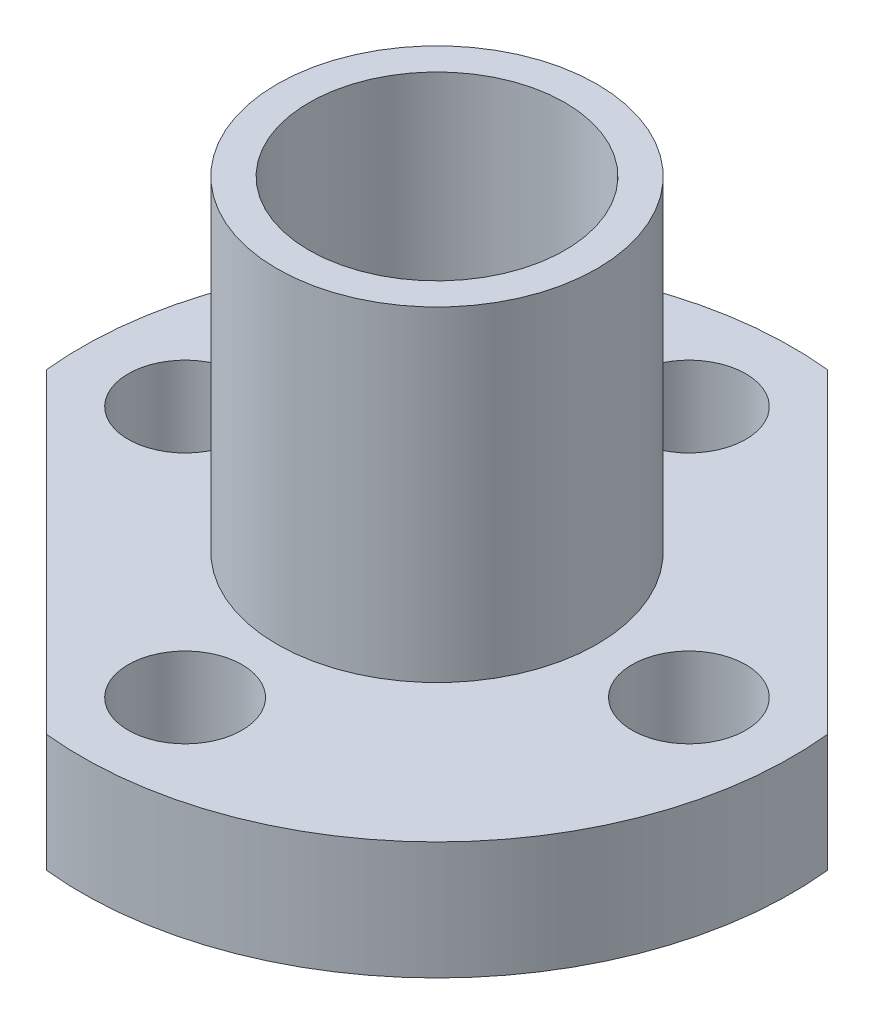
ISO-10303-21;
HEADER;
FILE_DESCRIPTION(('STEP AP214'),'2;1');
FILE_NAME('part.step','',(''),(''),'','','');
FILE_SCHEMA(('AUTOMOTIVE_DESIGN { 1 0 10303 214 1 1 1 1 }'));
ENDSEC;
DATA;
#1=APPLICATION_CONTEXT('core data for automotive mechanical design processes');
#2=APPLICATION_PROTOCOL_DEFINITION('international standard','automotive_design',2000,#1);
#3=PRODUCT_CONTEXT('',#1,'mechanical');
#4=PRODUCT('Part','Part','',(#3));
#5=PRODUCT_RELATED_PRODUCT_CATEGORY('part','',(#4));
#6=PRODUCT_DEFINITION_FORMATION('','',#4);
#7=PRODUCT_DEFINITION_CONTEXT('part definition',#1,'design');
#8=PRODUCT_DEFINITION('design','',#6,#7);
#9=PRODUCT_DEFINITION_SHAPE('','',#8);
#10=(LENGTH_UNIT() NAMED_UNIT(*) SI_UNIT(.MILLI.,.METRE.));
#11=(NAMED_UNIT(*) PLANE_ANGLE_UNIT() SI_UNIT($,.RADIAN.));
#12=(NAMED_UNIT(*) SI_UNIT($,.STERADIAN.) SOLID_ANGLE_UNIT());
#13=UNCERTAINTY_MEASURE_WITH_UNIT(LENGTH_MEASURE(1.E-05),#10,'distance_accuracy_value','');
#14=(GEOMETRIC_REPRESENTATION_CONTEXT(3) GLOBAL_UNCERTAINTY_ASSIGNED_CONTEXT((#13)) GLOBAL_UNIT_ASSIGNED_CONTEXT((#10,
#11,#12)) REPRESENTATION_CONTEXT('',''));
#15=CARTESIAN_POINT('',(0.,0.,0.));
#16=DIRECTION('',(0.,0.,1.));
#17=DIRECTION('',(1.,0.,0.));
#18=AXIS2_PLACEMENT_3D('',#15,#16,#17);
#19=CARTESIAN_POINT('',(0.,5.433000056,0.));
#20=DIRECTION('',(0.,-1.,0.));
#21=DIRECTION('',(0.,0.,-1.));
#22=AXIS2_PLACEMENT_3D('',#19,#20,#21);
#23=CYLINDRICAL_SURFACE('',#22,11.1);
#24=CARTESIAN_POINT('',(0.,1.750000056,0.));
#25=DIRECTION('',(0.,-1.,0.));
#26=DIRECTION('',(0.,0.,-1.));
#27=AXIS2_PLACEMENT_3D('',#24,#25,#26);
#28=CIRCLE('',#27,11.1);
#29=CARTESIAN_POINT('',(-11.0375732497331,1.750000056,1.17557507492091));
#30=VERTEX_POINT('',#29);
#31=CARTESIAN_POINT('',(1.1755750749209,1.750000056,-11.0375732497331));
#32=VERTEX_POINT('',#31);
#33=EDGE_CURVE('E82',#30,#32,#28,.T.);
#34=ORIENTED_EDGE('',*,*,#33,.F.);
#35=DIRECTION('',(0.,-1.,0.));
#36=VECTOR('',#35,1.);
#37=CARTESIAN_POINT('',(-11.0375732497331,5.433000056,1.1755750749209));
#38=LINE('',#37,#36);
#39=CARTESIAN_POINT('',(-11.0375732497331,5.433000056,1.17557507492091));
#40=VERTEX_POINT('',#39);
#41=EDGE_CURVE('E48',#30,#40,#38,.F.);
#42=ORIENTED_EDGE('',*,*,#41,.T.);
#43=CARTESIAN_POINT('',(0.,5.433000056,0.));
#44=DIRECTION('',(0.,-1.,0.));
#45=DIRECTION('',(0.,0.,-1.));
#46=AXIS2_PLACEMENT_3D('',#43,#44,#45);
#47=CIRCLE('',#46,11.1);
#48=CARTESIAN_POINT('',(1.1755750749209,5.433000056,-11.0375732497331));
#49=VERTEX_POINT('',#48);
#50=EDGE_CURVE('E84',#40,#49,#47,.T.);
#51=ORIENTED_EDGE('',*,*,#50,.T.);
#52=DIRECTION('',(0.,-1.,0.));
#53=VECTOR('',#52,1.);
#54=CARTESIAN_POINT('',(1.1755750749209,5.433000056,-11.0375732497331));
#55=LINE('',#54,#53);
#56=EDGE_CURVE('E72',#49,#32,#55,.T.);
#57=ORIENTED_EDGE('',*,*,#56,.T.);
#58=EDGE_LOOP('',(#34,#42,#51,#57));
#59=FACE_BOUND('',#58,.T.);
#60=ADVANCED_FACE('F33',(#59),#23,.T.);
#61=CARTESIAN_POINT('',(11.0375732497331,5.433000056,-1.1755750749209));
#62=VERTEX_POINT('',#61);
#63=CARTESIAN_POINT('',(-1.17557507492091,5.433000056,11.0375732497331));
#64=VERTEX_POINT('',#63);
#65=EDGE_CURVE('E103',#62,#64,#47,.T.);
#66=ORIENTED_EDGE('',*,*,#65,.T.);
#67=DIRECTION('',(0.,-1.,0.));
#68=VECTOR('',#67,1.);
#69=CARTESIAN_POINT('',(-1.1755750749209,5.433000056,11.0375732497331));
#70=LINE('',#69,#68);
#71=CARTESIAN_POINT('',(-1.17557507492091,1.750000056,11.0375732497331));
#72=VERTEX_POINT('',#71);
#73=EDGE_CURVE('E294',#64,#72,#70,.T.);
#74=ORIENTED_EDGE('',*,*,#73,.T.);
#75=CARTESIAN_POINT('',(11.0375732497331,1.750000056,-1.1755750749209));
#76=VERTEX_POINT('',#75);
#77=EDGE_CURVE('E88',#76,#72,#28,.T.);
#78=ORIENTED_EDGE('',*,*,#77,.F.);
#79=DIRECTION('',(0.,-1.,0.));
#80=VECTOR('',#79,1.);
#81=CARTESIAN_POINT('',(11.0375732497331,5.433000056,-1.1755750749209));
#82=LINE('',#81,#80);
#83=EDGE_CURVE('E55',#76,#62,#82,.F.);
#84=ORIENTED_EDGE('',*,*,#83,.T.);
#85=EDGE_LOOP('',(#66,#74,#78,#84));
#86=FACE_BOUND('',#85,.T.);
#87=ADVANCED_FACE('F133',(#86),#23,.T.);
#88=CARTESIAN_POINT('',(0.,5.433000056,0.));
#89=DIRECTION('',(0.,-1.,0.));
#90=DIRECTION('',(0.,0.,-1.));
#91=AXIS2_PLACEMENT_3D('',#88,#89,#90);
#92=PLANE('',#91);
#93=CARTESIAN_POINT('',(7.874,5.433000056,0.));
#94=DIRECTION('',(0.,-1.,0.));
#95=DIRECTION('',(0.,0.,-1.));
#96=AXIS2_PLACEMENT_3D('',#93,#94,#95);
#97=CIRCLE('',#96,1.778);
#98=CARTESIAN_POINT('',(7.874,5.433000056,-1.778));
#99=VERTEX_POINT('',#98);
#100=EDGE_CURVE('E265',#99,#99,#97,.T.);
#101=ORIENTED_EDGE('',*,*,#100,.T.);
#102=EDGE_LOOP('',(#101));
#103=FACE_BOUND('',#102,.T.);
#104=CARTESIAN_POINT('',(0.,5.433000056,7.874));
#105=DIRECTION('',(0.,-1.,0.));
#106=DIRECTION('',(0.,0.,-1.));
#107=AXIS2_PLACEMENT_3D('',#104,#105,#106);
#108=CIRCLE('',#107,1.778);
#109=CARTESIAN_POINT('',(0.,5.433000056,6.096));
#110=VERTEX_POINT('',#109);
#111=EDGE_CURVE('E269',#110,#110,#108,.T.);
#112=ORIENTED_EDGE('',*,*,#111,.T.);
#113=EDGE_LOOP('',(#112));
#114=FACE_BOUND('',#113,.T.);
#115=CARTESIAN_POINT('',(-7.874,5.433000056,0.));
#116=DIRECTION('',(0.,-1.,0.));
#117=DIRECTION('',(0.,0.,-1.));
#118=AXIS2_PLACEMENT_3D('',#115,#116,#117);
#119=CIRCLE('',#118,1.778);
#120=CARTESIAN_POINT('',(-7.874,5.433000056,-1.778));
#121=VERTEX_POINT('',#120);
#122=EDGE_CURVE('E273',#121,#121,#119,.T.);
#123=ORIENTED_EDGE('',*,*,#122,.T.);
#124=EDGE_LOOP('',(#123));
#125=FACE_BOUND('',#124,.T.);
#126=CARTESIAN_POINT('',(0.,5.433000056,-7.874));
#127=DIRECTION('',(0.,-1.,0.));
#128=DIRECTION('',(0.,0.,-1.));
#129=AXIS2_PLACEMENT_3D('',#126,#127,#128);
#130=CIRCLE('',#129,1.778);
#131=CARTESIAN_POINT('',(0.,5.433000056,-9.652));
#132=VERTEX_POINT('',#131);
#133=EDGE_CURVE('E92',#132,#132,#130,.T.);
#134=ORIENTED_EDGE('',*,*,#133,.T.);
#135=EDGE_LOOP('',(#134));
#136=FACE_BOUND('',#135,.T.);
#137=CARTESIAN_POINT('',(0.,5.433000056,0.));
#138=DIRECTION('',(0.,-1.,0.));
#139=DIRECTION('',(0.,0.,-1.));
#140=AXIS2_PLACEMENT_3D('',#137,#138,#139);
#141=CIRCLE('',#140,5.);
#142=CARTESIAN_POINT('',(0.,5.433000056,-5.));
#143=VERTEX_POINT('',#142);
#144=EDGE_CURVE('E78',#143,#143,#141,.T.);
#145=ORIENTED_EDGE('',*,*,#144,.T.);
#146=EDGE_LOOP('',(#145));
#147=FACE_BOUND('',#146,.T.);
#148=DIRECTION('',(-0.707106781186548,0.,-0.707106781186548));
#149=VECTOR('',#148,1.);
#150=CARTESIAN_POINT('',(-6.10657416232703,5.433000056,6.10657416232703));
#151=LINE('',#150,#149);
#152=EDGE_CURVE('E297',#64,#40,#151,.T.);
#153=ORIENTED_EDGE('',*,*,#152,.F.);
#154=ORIENTED_EDGE('',*,*,#65,.F.);
#155=DIRECTION('',(0.707106781186548,0.,0.707106781186548));
#156=VECTOR('',#155,1.);
#157=CARTESIAN_POINT('',(6.10657416232702,5.433000056,-6.10657416232702));
#158=LINE('',#157,#156);
#159=EDGE_CURVE('E85',#49,#62,#158,.T.);
#160=ORIENTED_EDGE('',*,*,#159,.F.);
#161=ORIENTED_EDGE('',*,*,#50,.F.);
#162=EDGE_LOOP('',(#153,#154,#160,#161));
#163=FACE_BOUND('',#162,.T.);
#164=ADVANCED_FACE('F112',(#103,#114,#125,#136,#147,#163),#92,.F.);
#165=CARTESIAN_POINT('',(0.,1.750000056,0.));
#166=DIRECTION('',(0.,-1.,0.));
#167=DIRECTION('',(0.,0.,-1.));
#168=AXIS2_PLACEMENT_3D('',#165,#166,#167);
#169=PLANE('',#168);
#170=CARTESIAN_POINT('',(7.874,1.750000056,0.));
#171=DIRECTION('',(0.,-1.,0.));
#172=DIRECTION('',(0.,0.,-1.));
#173=AXIS2_PLACEMENT_3D('',#170,#171,#172);
#174=CIRCLE('',#173,1.778);
#175=CARTESIAN_POINT('',(7.874,1.750000056,-1.778));
#176=VERTEX_POINT('',#175);
#177=EDGE_CURVE('E289',#176,#176,#174,.T.);
#178=ORIENTED_EDGE('',*,*,#177,.F.);
#179=EDGE_LOOP('',(#178));
#180=FACE_BOUND('',#179,.T.);
#181=CARTESIAN_POINT('',(0.,1.750000056,7.874));
#182=DIRECTION('',(0.,-1.,0.));
#183=DIRECTION('',(0.,0.,-1.));
#184=AXIS2_PLACEMENT_3D('',#181,#182,#183);
#185=CIRCLE('',#184,1.778);
#186=CARTESIAN_POINT('',(0.,1.750000056,6.096));
#187=VERTEX_POINT('',#186);
#188=EDGE_CURVE('E285',#187,#187,#185,.T.);
#189=ORIENTED_EDGE('',*,*,#188,.F.);
#190=EDGE_LOOP('',(#189));
#191=FACE_BOUND('',#190,.T.);
#192=CARTESIAN_POINT('',(-7.874,1.750000056,0.));
#193=DIRECTION('',(0.,-1.,0.));
#194=DIRECTION('',(0.,0.,-1.));
#195=AXIS2_PLACEMENT_3D('',#192,#193,#194);
#196=CIRCLE('',#195,1.778);
#197=CARTESIAN_POINT('',(-7.874,1.750000056,-1.778));
#198=VERTEX_POINT('',#197);
#199=EDGE_CURVE('E281',#198,#198,#196,.T.);
#200=ORIENTED_EDGE('',*,*,#199,.F.);
#201=EDGE_LOOP('',(#200));
#202=FACE_BOUND('',#201,.T.);
#203=CARTESIAN_POINT('',(0.,1.750000056,-7.874));
#204=DIRECTION('',(0.,-1.,0.));
#205=DIRECTION('',(0.,0.,-1.));
#206=AXIS2_PLACEMENT_3D('',#203,#204,#205);
#207=CIRCLE('',#206,1.778);
#208=CARTESIAN_POINT('',(0.,1.750000056,-9.652));
#209=VERTEX_POINT('',#208);
#210=EDGE_CURVE('E276',#209,#209,#207,.T.);
#211=ORIENTED_EDGE('',*,*,#210,.F.);
#212=EDGE_LOOP('',(#211));
#213=FACE_BOUND('',#212,.T.);
#214=CARTESIAN_POINT('',(0.,1.750000056,0.));
#215=DIRECTION('',(0.,-1.,0.));
#216=DIRECTION('',(0.,0.,-1.));
#217=AXIS2_PLACEMENT_3D('',#214,#215,#216);
#218=CIRCLE('',#217,5.);
#219=CARTESIAN_POINT('',(0.,1.750000056,-5.));
#220=VERTEX_POINT('',#219);
#221=EDGE_CURVE('E89',#220,#220,#218,.T.);
#222=ORIENTED_EDGE('',*,*,#221,.F.);
#223=EDGE_LOOP('',(#222));
#224=FACE_BOUND('',#223,.T.);
#225=ORIENTED_EDGE('',*,*,#77,.T.);
#226=DIRECTION('',(-0.707106781186548,0.,-0.707106781186548));
#227=VECTOR('',#226,1.);
#228=CARTESIAN_POINT('',(-6.10657416232703,1.750000056,6.10657416232703));
#229=LINE('',#228,#227);
#230=EDGE_CURVE('E12',#72,#30,#229,.T.);
#231=ORIENTED_EDGE('',*,*,#230,.T.);
#232=ORIENTED_EDGE('',*,*,#33,.T.);
#233=DIRECTION('',(0.707106781186548,0.,0.707106781186548));
#234=VECTOR('',#233,1.);
#235=CARTESIAN_POINT('',(6.10657416232702,1.750000056,-6.10657416232702));
#236=LINE('',#235,#234);
#237=EDGE_CURVE('E41',#32,#76,#236,.T.);
#238=ORIENTED_EDGE('',*,*,#237,.T.);
#239=EDGE_LOOP('',(#225,#231,#232,#238));
#240=FACE_BOUND('',#239,.T.);
#241=ADVANCED_FACE('F87',(#180,#191,#202,#213,#224,#240),#169,.T.);
#242=CARTESIAN_POINT('',(0.,15.6,0.));
#243=DIRECTION('',(0.,-1.,0.));
#244=DIRECTION('',(0.,0.,-1.));
#245=AXIS2_PLACEMENT_3D('',#242,#243,#244);
#246=CYLINDRICAL_SURFACE('',#245,5.);
#247=CARTESIAN_POINT('',(0.,15.6,0.));
#248=DIRECTION('',(0.,1.,0.));
#249=DIRECTION('',(0.,0.,1.));
#250=AXIS2_PLACEMENT_3D('',#247,#248,#249);
#251=CIRCLE('',#250,5.);
#252=CARTESIAN_POINT('',(0.,15.6,5.));
#253=VERTEX_POINT('',#252);
#254=EDGE_CURVE('E104',#253,#253,#251,.T.);
#255=ORIENTED_EDGE('',*,*,#254,.F.);
#256=EDGE_LOOP('',(#255));
#257=FACE_BOUND('',#256,.T.);
#258=ORIENTED_EDGE('',*,*,#144,.F.);
#259=EDGE_LOOP('',(#258));
#260=FACE_BOUND('',#259,.T.);
#261=ADVANCED_FACE('F115',(#257,#260),#246,.T.);
#262=CARTESIAN_POINT('',(0.,15.6,0.));
#263=DIRECTION('',(0.,1.,0.));
#264=DIRECTION('',(0.,0.,1.));
#265=AXIS2_PLACEMENT_3D('',#262,#263,#264);
#266=PLANE('',#265);
#267=ORIENTED_EDGE('',*,*,#254,.T.);
#268=EDGE_LOOP('',(#267));
#269=FACE_BOUND('',#268,.T.);
#270=CARTESIAN_POINT('',(0.,15.6,0.));
#271=DIRECTION('',(0.,1.,0.));
#272=DIRECTION('',(0.,0.,1.));
#273=AXIS2_PLACEMENT_3D('',#270,#271,#272);
#274=CIRCLE('',#273,4.);
#275=CARTESIAN_POINT('',(0.,15.6,4.));
#276=VERTEX_POINT('',#275);
#277=EDGE_CURVE('E96',#276,#276,#274,.T.);
#278=ORIENTED_EDGE('',*,*,#277,.F.);
#279=EDGE_LOOP('',(#278));
#280=FACE_BOUND('',#279,.T.);
#281=ADVANCED_FACE('F117',(#269,#280),#266,.T.);
#282=CARTESIAN_POINT('',(0.,0.,0.));
#283=DIRECTION('',(0.,1.,0.));
#284=DIRECTION('',(0.,0.,1.));
#285=AXIS2_PLACEMENT_3D('',#282,#283,#284);
#286=PLANE('',#285);
#287=CARTESIAN_POINT('',(0.,0.,0.));
#288=DIRECTION('',(0.,1.,0.));
#289=DIRECTION('',(0.,0.,1.));
#290=AXIS2_PLACEMENT_3D('',#287,#288,#289);
#291=CIRCLE('',#290,5.);
#292=CARTESIAN_POINT('',(0.,0.,5.));
#293=VERTEX_POINT('',#292);
#294=EDGE_CURVE('E99',#293,#293,#291,.T.);
#295=ORIENTED_EDGE('',*,*,#294,.F.);
#296=EDGE_LOOP('',(#295));
#297=FACE_BOUND('',#296,.T.);
#298=CARTESIAN_POINT('',(0.,0.,0.));
#299=DIRECTION('',(0.,1.,0.));
#300=DIRECTION('',(0.,0.,1.));
#301=AXIS2_PLACEMENT_3D('',#298,#299,#300);
#302=CIRCLE('',#301,4.);
#303=CARTESIAN_POINT('',(0.,0.,4.));
#304=VERTEX_POINT('',#303);
#305=EDGE_CURVE('E100',#304,#304,#302,.T.);
#306=ORIENTED_EDGE('',*,*,#305,.T.);
#307=EDGE_LOOP('',(#306));
#308=FACE_BOUND('',#307,.T.);
#309=ADVANCED_FACE('F123',(#297,#308),#286,.F.);
#310=ORIENTED_EDGE('',*,*,#221,.T.);
#311=EDGE_LOOP('',(#310));
#312=FACE_BOUND('',#311,.T.);
#313=ORIENTED_EDGE('',*,*,#294,.T.);
#314=EDGE_LOOP('',(#313));
#315=FACE_BOUND('',#314,.T.);
#316=ADVANCED_FACE('F35',(#312,#315),#246,.T.);
#317=CARTESIAN_POINT('',(0.,15.6,0.));
#318=DIRECTION('',(0.,-1.,0.));
#319=DIRECTION('',(0.,0.,-1.));
#320=AXIS2_PLACEMENT_3D('',#317,#318,#319);
#321=CYLINDRICAL_SURFACE('',#320,4.);
#322=ORIENTED_EDGE('',*,*,#277,.T.);
#323=EDGE_LOOP('',(#322));
#324=FACE_BOUND('',#323,.T.);
#325=ORIENTED_EDGE('',*,*,#305,.F.);
#326=EDGE_LOOP('',(#325));
#327=FACE_BOUND('',#326,.T.);
#328=ADVANCED_FACE('F130',(#324,#327),#321,.F.);
#329=CARTESIAN_POINT('',(0.,5.433000056,-7.874));
#330=DIRECTION('',(0.,-1.,0.));
#331=DIRECTION('',(0.,0.,-1.));
#332=AXIS2_PLACEMENT_3D('',#329,#330,#331);
#333=CYLINDRICAL_SURFACE('',#332,1.778);
#334=ORIENTED_EDGE('',*,*,#133,.F.);
#335=EDGE_LOOP('',(#334));
#336=FACE_BOUND('',#335,.T.);
#337=ORIENTED_EDGE('',*,*,#210,.T.);
#338=EDGE_LOOP('',(#337));
#339=FACE_BOUND('',#338,.T.);
#340=ADVANCED_FACE('F142',(#336,#339),#333,.F.);
#341=CARTESIAN_POINT('',(-7.874,5.433000056,0.));
#342=DIRECTION('',(0.,-1.,0.));
#343=DIRECTION('',(0.,0.,-1.));
#344=AXIS2_PLACEMENT_3D('',#341,#342,#343);
#345=CYLINDRICAL_SURFACE('',#344,1.778);
#346=ORIENTED_EDGE('',*,*,#122,.F.);
#347=EDGE_LOOP('',(#346));
#348=FACE_BOUND('',#347,.T.);
#349=ORIENTED_EDGE('',*,*,#199,.T.);
#350=EDGE_LOOP('',(#349));
#351=FACE_BOUND('',#350,.T.);
#352=ADVANCED_FACE('F169',(#348,#351),#345,.F.);
#353=CARTESIAN_POINT('',(0.,5.433000056,7.874));
#354=DIRECTION('',(0.,-1.,0.));
#355=DIRECTION('',(0.,0.,-1.));
#356=AXIS2_PLACEMENT_3D('',#353,#354,#355);
#357=CYLINDRICAL_SURFACE('',#356,1.778);
#358=ORIENTED_EDGE('',*,*,#111,.F.);
#359=EDGE_LOOP('',(#358));
#360=FACE_BOUND('',#359,.T.);
#361=ORIENTED_EDGE('',*,*,#188,.T.);
#362=EDGE_LOOP('',(#361));
#363=FACE_BOUND('',#362,.T.);
#364=ADVANCED_FACE('F177',(#360,#363),#357,.F.);
#365=CARTESIAN_POINT('',(7.874,5.433000056,0.));
#366=DIRECTION('',(0.,-1.,0.));
#367=DIRECTION('',(0.,0.,-1.));
#368=AXIS2_PLACEMENT_3D('',#365,#366,#367);
#369=CYLINDRICAL_SURFACE('',#368,1.778);
#370=ORIENTED_EDGE('',*,*,#100,.F.);
#371=EDGE_LOOP('',(#370));
#372=FACE_BOUND('',#371,.T.);
#373=ORIENTED_EDGE('',*,*,#177,.T.);
#374=EDGE_LOOP('',(#373));
#375=FACE_BOUND('',#374,.T.);
#376=ADVANCED_FACE('F185',(#372,#375),#369,.F.);
#377=CARTESIAN_POINT('',(0.0108924172220275,15.6,-12.202255907432));
#378=DIRECTION('',(0.707106781186547,0.,-0.707106781186547));
#379=DIRECTION('',(-0.707106781186548,0.,-0.707106781186548));
#380=AXIS2_PLACEMENT_3D('',#377,#378,#379);
#381=PLANE('',#380);
#382=ORIENTED_EDGE('',*,*,#237,.F.);
#383=ORIENTED_EDGE('',*,*,#56,.F.);
#384=ORIENTED_EDGE('',*,*,#159,.T.);
#385=ORIENTED_EDGE('',*,*,#83,.F.);
#386=EDGE_LOOP('',(#382,#383,#384,#385));
#387=FACE_BOUND('',#386,.T.);
#388=ADVANCED_FACE('F71',(#387),#381,.T.);
#389=CARTESIAN_POINT('',(4.10346750377007,15.6,16.3166158284241));
#390=DIRECTION('',(-0.707106781186547,0.,0.707106781186547));
#391=DIRECTION('',(0.707106781186548,0.,0.707106781186548));
#392=AXIS2_PLACEMENT_3D('',#389,#390,#391);
#393=PLANE('',#392);
#394=ORIENTED_EDGE('',*,*,#230,.F.);
#395=ORIENTED_EDGE('',*,*,#73,.F.);
#396=ORIENTED_EDGE('',*,*,#152,.T.);
#397=ORIENTED_EDGE('',*,*,#41,.F.);
#398=EDGE_LOOP('',(#394,#395,#396,#397));
#399=FACE_BOUND('',#398,.T.);
#400=ADVANCED_FACE('F200',(#399),#393,.T.);
#401=CLOSED_SHELL('',(#60,#87,#164,#241,#261,#281,#309,#316,#328,#340,#352,#364,#376,#388,#400));
#402=MANIFOLD_SOLID_BREP('B2',#401);
#403=ADVANCED_BREP_SHAPE_REPRESENTATION('',(#18,#402),#14);
#404=SHAPE_DEFINITION_REPRESENTATION(#9,#403);
ENDSEC;
END-ISO-10303-21;
